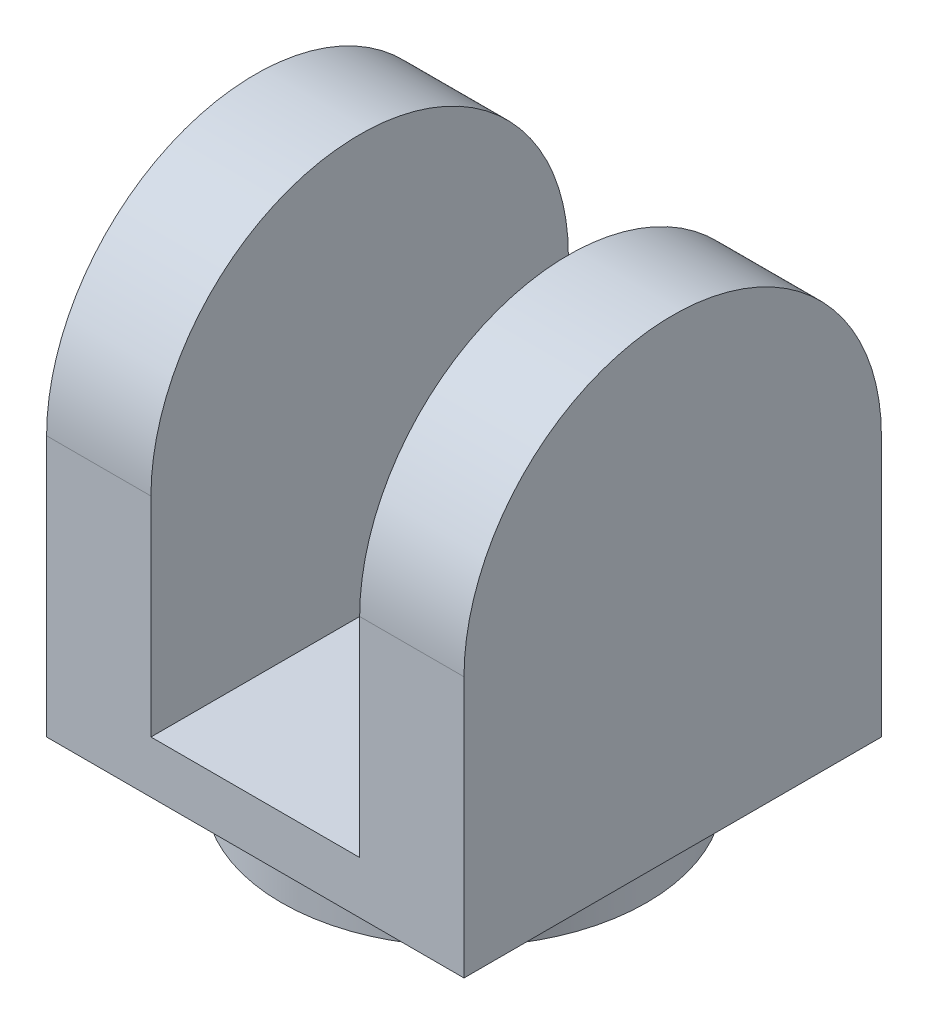
ISO-10303-21;
HEADER;
FILE_DESCRIPTION(('STEP AP214'),'2;1');
FILE_NAME('part.step','',(''),(''),'','','');
FILE_SCHEMA(('AUTOMOTIVE_DESIGN { 1 0 10303 214 1 1 1 1 }'));
ENDSEC;
DATA;
#1=APPLICATION_CONTEXT('core data for automotive mechanical design processes');
#2=APPLICATION_PROTOCOL_DEFINITION('international standard','automotive_design',2000,#1);
#3=PRODUCT_CONTEXT('',#1,'mechanical');
#4=PRODUCT('Part','Part','',(#3));
#5=PRODUCT_RELATED_PRODUCT_CATEGORY('part','',(#4));
#6=PRODUCT_DEFINITION_FORMATION('','',#4);
#7=PRODUCT_DEFINITION_CONTEXT('part definition',#1,'design');
#8=PRODUCT_DEFINITION('design','',#6,#7);
#9=PRODUCT_DEFINITION_SHAPE('','',#8);
#10=(LENGTH_UNIT() NAMED_UNIT(*) SI_UNIT(.MILLI.,.METRE.));
#11=(NAMED_UNIT(*) PLANE_ANGLE_UNIT() SI_UNIT($,.RADIAN.));
#12=(NAMED_UNIT(*) SI_UNIT($,.STERADIAN.) SOLID_ANGLE_UNIT());
#13=UNCERTAINTY_MEASURE_WITH_UNIT(LENGTH_MEASURE(1.E-05),#10,'distance_accuracy_value','');
#14=(GEOMETRIC_REPRESENTATION_CONTEXT(3) GLOBAL_UNCERTAINTY_ASSIGNED_CONTEXT((#13)) GLOBAL_UNIT_ASSIGNED_CONTEXT((#10,
#11,#12)) REPRESENTATION_CONTEXT('',''));
#15=CARTESIAN_POINT('',(0.,0.,0.));
#16=DIRECTION('',(0.,0.,1.));
#17=DIRECTION('',(1.,0.,0.));
#18=AXIS2_PLACEMENT_3D('',#15,#16,#17);
#19=CARTESIAN_POINT('',(-8.,20.,-8.));
#20=DIRECTION('',(0.,0.,1.));
#21=DIRECTION('',(1.,0.,0.));
#22=AXIS2_PLACEMENT_3D('',#19,#20,#21);
#23=PLANE('',#22);
#24=DIRECTION('',(1.,0.,0.));
#25=VECTOR('',#24,1.);
#26=CARTESIAN_POINT('',(-8.,12.,-7.99999999999999));
#27=LINE('',#26,#25);
#28=CARTESIAN_POINT('',(4.,12.,-8.));
#29=VERTEX_POINT('',#28);
#30=CARTESIAN_POINT('',(8.,12.,-8.));
#31=VERTEX_POINT('',#30);
#32=EDGE_CURVE('E109',#29,#31,#27,.T.);
#33=ORIENTED_EDGE('',*,*,#32,.T.);
#34=DIRECTION('',(0.,-1.,0.));
#35=VECTOR('',#34,1.);
#36=CARTESIAN_POINT('',(8.,20.,-8.));
#37=LINE('',#36,#35);
#38=CARTESIAN_POINT('',(8.,2.,-8.));
#39=VERTEX_POINT('',#38);
#40=EDGE_CURVE('E120',#31,#39,#37,.T.);
#41=ORIENTED_EDGE('',*,*,#40,.T.);
#42=DIRECTION('',(-1.,0.,0.));
#43=VECTOR('',#42,1.);
#44=CARTESIAN_POINT('',(-8.,2.,-8.));
#45=LINE('',#44,#43);
#46=CARTESIAN_POINT('',(-8.,2.,-8.));
#47=VERTEX_POINT('',#46);
#48=EDGE_CURVE('E118',#39,#47,#45,.T.);
#49=ORIENTED_EDGE('',*,*,#48,.T.);
#50=DIRECTION('',(0.,-1.,0.));
#51=VECTOR('',#50,1.);
#52=CARTESIAN_POINT('',(-8.,20.,-8.));
#53=LINE('',#52,#51);
#54=CARTESIAN_POINT('',(-8.,12.,-7.99999999999999));
#55=VERTEX_POINT('',#54);
#56=EDGE_CURVE('E61',#55,#47,#53,.T.);
#57=ORIENTED_EDGE('',*,*,#56,.F.);
#58=CARTESIAN_POINT('',(-4.,12.,-8.));
#59=VERTEX_POINT('',#58);
#60=EDGE_CURVE('E103',#55,#59,#27,.T.);
#61=ORIENTED_EDGE('',*,*,#60,.T.);
#62=DIRECTION('',(0.,-1.,0.));
#63=VECTOR('',#62,1.);
#64=CARTESIAN_POINT('',(-4.,20.,-8.));
#65=LINE('',#64,#63);
#66=CARTESIAN_POINT('',(-4.,4.,-8.));
#67=VERTEX_POINT('',#66);
#68=EDGE_CURVE('E180',#59,#67,#65,.T.);
#69=ORIENTED_EDGE('',*,*,#68,.T.);
#70=DIRECTION('',(1.,0.,0.));
#71=VECTOR('',#70,1.);
#72=CARTESIAN_POINT('',(-4.,4.,-8.));
#73=LINE('',#72,#71);
#74=CARTESIAN_POINT('',(4.,4.,-8.));
#75=VERTEX_POINT('',#74);
#76=EDGE_CURVE('E182',#67,#75,#73,.T.);
#77=ORIENTED_EDGE('',*,*,#76,.T.);
#78=DIRECTION('',(0.,1.,0.));
#79=VECTOR('',#78,1.);
#80=CARTESIAN_POINT('',(4.,20.,-8.));
#81=LINE('',#80,#79);
#82=EDGE_CURVE('E186',#75,#29,#81,.T.);
#83=ORIENTED_EDGE('',*,*,#82,.T.);
#84=EDGE_LOOP('',(#33,#41,#49,#57,#61,#69,#77,#83));
#85=FACE_BOUND('',#84,.T.);
#86=ADVANCED_FACE('F38',(#85),#23,.F.);
#87=CARTESIAN_POINT('',(0.,2.,0.));
#88=DIRECTION('',(0.,-1.,0.));
#89=DIRECTION('',(0.,0.,-1.));
#90=AXIS2_PLACEMENT_3D('',#87,#88,#89);
#91=CYLINDRICAL_SURFACE('',#90,7.);
#92=CARTESIAN_POINT('',(0.,2.,0.));
#93=DIRECTION('',(0.,1.,0.));
#94=DIRECTION('',(0.,0.,1.));
#95=AXIS2_PLACEMENT_3D('',#92,#93,#94);
#96=CIRCLE('',#95,7.);
#97=CARTESIAN_POINT('',(0.,2.,7.));
#98=VERTEX_POINT('',#97);
#99=EDGE_CURVE('E46',#98,#98,#96,.T.);
#100=ORIENTED_EDGE('',*,*,#99,.F.);
#101=EDGE_LOOP('',(#100));
#102=FACE_BOUND('',#101,.T.);
#103=CARTESIAN_POINT('',(0.,0.,0.));
#104=DIRECTION('',(0.,1.,0.));
#105=DIRECTION('',(0.,0.,1.));
#106=AXIS2_PLACEMENT_3D('',#103,#104,#105);
#107=CIRCLE('',#106,7.);
#108=CARTESIAN_POINT('',(0.,0.,7.));
#109=VERTEX_POINT('',#108);
#110=EDGE_CURVE('E130',#109,#109,#107,.T.);
#111=ORIENTED_EDGE('',*,*,#110,.T.);
#112=EDGE_LOOP('',(#111));
#113=FACE_BOUND('',#112,.T.);
#114=ADVANCED_FACE('F40',(#102,#113),#91,.T.);
#115=CARTESIAN_POINT('',(0.,0.,0.));
#116=DIRECTION('',(0.,1.,0.));
#117=DIRECTION('',(0.,0.,1.));
#118=AXIS2_PLACEMENT_3D('',#115,#116,#117);
#119=PLANE('',#118);
#120=ORIENTED_EDGE('',*,*,#110,.F.);
#121=EDGE_LOOP('',(#120));
#122=FACE_BOUND('',#121,.T.);
#123=ADVANCED_FACE('F136',(#122),#119,.F.);
#124=CARTESIAN_POINT('',(-8.,20.,-8.));
#125=DIRECTION('',(1.,0.,0.));
#126=DIRECTION('',(0.,0.,-1.));
#127=AXIS2_PLACEMENT_3D('',#124,#125,#126);
#128=PLANE('',#127);
#129=DIRECTION('',(0.,-1.,0.));
#130=VECTOR('',#129,1.);
#131=CARTESIAN_POINT('',(-7.99999999999999,20.,8.));
#132=LINE('',#131,#130);
#133=CARTESIAN_POINT('',(-7.99999999999999,12.,8.00000000000001));
#134=VERTEX_POINT('',#133);
#135=CARTESIAN_POINT('',(-7.99999999999999,2.,8.));
#136=VERTEX_POINT('',#135);
#137=EDGE_CURVE('E113',#134,#136,#132,.T.);
#138=ORIENTED_EDGE('',*,*,#137,.F.);
#139=CARTESIAN_POINT('',(-8.,12.,0.));
#140=DIRECTION('',(-1.,0.,0.));
#141=DIRECTION('',(0.,0.,-1.));
#142=AXIS2_PLACEMENT_3D('',#139,#140,#141);
#143=CIRCLE('',#142,8.);
#144=EDGE_CURVE('E105',#134,#55,#143,.T.);
#145=ORIENTED_EDGE('',*,*,#144,.T.);
#146=ORIENTED_EDGE('',*,*,#56,.T.);
#147=DIRECTION('',(0.,0.,1.));
#148=VECTOR('',#147,1.);
#149=CARTESIAN_POINT('',(-8.,2.,-8.));
#150=LINE('',#149,#148);
#151=EDGE_CURVE('E197',#47,#136,#150,.T.);
#152=ORIENTED_EDGE('',*,*,#151,.T.);
#153=EDGE_LOOP('',(#138,#145,#146,#152));
#154=FACE_BOUND('',#153,.T.);
#155=ADVANCED_FACE('F112',(#154),#128,.F.);
#156=CARTESIAN_POINT('',(-7.99999999999999,20.,8.));
#157=DIRECTION('',(0.,0.,-1.));
#158=DIRECTION('',(-1.,0.,0.));
#159=AXIS2_PLACEMENT_3D('',#156,#157,#158);
#160=PLANE('',#159);
#161=DIRECTION('',(0.,-1.,0.));
#162=VECTOR('',#161,1.);
#163=CARTESIAN_POINT('',(8.00000000000001,20.,8.));
#164=LINE('',#163,#162);
#165=CARTESIAN_POINT('',(8.00000000000001,12.,8.));
#166=VERTEX_POINT('',#165);
#167=CARTESIAN_POINT('',(8.00000000000001,2.,8.));
#168=VERTEX_POINT('',#167);
#169=EDGE_CURVE('E122',#166,#168,#164,.T.);
#170=ORIENTED_EDGE('',*,*,#169,.F.);
#171=DIRECTION('',(1.,0.,0.));
#172=VECTOR('',#171,1.);
#173=CARTESIAN_POINT('',(-7.99999999999999,12.,8.00000000000001));
#174=LINE('',#173,#172);
#175=CARTESIAN_POINT('',(4.,12.,8.));
#176=VERTEX_POINT('',#175);
#177=EDGE_CURVE('E108',#176,#166,#174,.T.);
#178=ORIENTED_EDGE('',*,*,#177,.F.);
#179=DIRECTION('',(0.,1.,0.));
#180=VECTOR('',#179,1.);
#181=CARTESIAN_POINT('',(4.,20.,8.));
#182=LINE('',#181,#180);
#183=CARTESIAN_POINT('',(4.,4.,8.));
#184=VERTEX_POINT('',#183);
#185=EDGE_CURVE('E183',#184,#176,#182,.T.);
#186=ORIENTED_EDGE('',*,*,#185,.F.);
#187=DIRECTION('',(1.,0.,0.));
#188=VECTOR('',#187,1.);
#189=CARTESIAN_POINT('',(-4.,4.,8.));
#190=LINE('',#189,#188);
#191=CARTESIAN_POINT('',(-4.,4.,8.));
#192=VERTEX_POINT('',#191);
#193=EDGE_CURVE('E191',#192,#184,#190,.T.);
#194=ORIENTED_EDGE('',*,*,#193,.F.);
#195=DIRECTION('',(0.,-1.,0.));
#196=VECTOR('',#195,1.);
#197=CARTESIAN_POINT('',(-4.,20.,8.));
#198=LINE('',#197,#196);
#199=CARTESIAN_POINT('',(-4.,12.,8.));
#200=VERTEX_POINT('',#199);
#201=EDGE_CURVE('E179',#200,#192,#198,.T.);
#202=ORIENTED_EDGE('',*,*,#201,.F.);
#203=EDGE_CURVE('E176',#134,#200,#174,.T.);
#204=ORIENTED_EDGE('',*,*,#203,.F.);
#205=ORIENTED_EDGE('',*,*,#137,.T.);
#206=DIRECTION('',(1.,0.,0.));
#207=VECTOR('',#206,1.);
#208=CARTESIAN_POINT('',(-7.99999999999999,2.,8.));
#209=LINE('',#208,#207);
#210=EDGE_CURVE('E167',#136,#168,#209,.T.);
#211=ORIENTED_EDGE('',*,*,#210,.T.);
#212=EDGE_LOOP('',(#170,#178,#186,#194,#202,#204,#205,#211));
#213=FACE_BOUND('',#212,.T.);
#214=ADVANCED_FACE('F142',(#213),#160,.F.);
#215=CARTESIAN_POINT('',(8.,20.,-8.));
#216=DIRECTION('',(-1.,0.,0.));
#217=DIRECTION('',(0.,0.,1.));
#218=AXIS2_PLACEMENT_3D('',#215,#216,#217);
#219=PLANE('',#218);
#220=ORIENTED_EDGE('',*,*,#40,.F.);
#221=CARTESIAN_POINT('',(8.,12.,0.));
#222=DIRECTION('',(-1.,0.,0.));
#223=DIRECTION('',(0.,0.,-1.));
#224=AXIS2_PLACEMENT_3D('',#221,#222,#223);
#225=CIRCLE('',#224,8.);
#226=EDGE_CURVE('E114',#166,#31,#225,.T.);
#227=ORIENTED_EDGE('',*,*,#226,.F.);
#228=ORIENTED_EDGE('',*,*,#169,.T.);
#229=DIRECTION('',(0.,0.,-1.));
#230=VECTOR('',#229,1.);
#231=CARTESIAN_POINT('',(8.,2.,-8.));
#232=LINE('',#231,#230);
#233=EDGE_CURVE('E124',#168,#39,#232,.T.);
#234=ORIENTED_EDGE('',*,*,#233,.T.);
#235=EDGE_LOOP('',(#220,#227,#228,#234));
#236=FACE_BOUND('',#235,.T.);
#237=ADVANCED_FACE('F153',(#236),#219,.F.);
#238=CARTESIAN_POINT('',(0.,2.,0.));
#239=DIRECTION('',(0.,1.,0.));
#240=DIRECTION('',(0.,0.,1.));
#241=AXIS2_PLACEMENT_3D('',#238,#239,#240);
#242=PLANE('',#241);
#243=ORIENTED_EDGE('',*,*,#99,.T.);
#244=EDGE_LOOP('',(#243));
#245=FACE_BOUND('',#244,.T.);
#246=ORIENTED_EDGE('',*,*,#151,.F.);
#247=ORIENTED_EDGE('',*,*,#48,.F.);
#248=ORIENTED_EDGE('',*,*,#233,.F.);
#249=ORIENTED_EDGE('',*,*,#210,.F.);
#250=EDGE_LOOP('',(#246,#247,#248,#249));
#251=FACE_BOUND('',#250,.T.);
#252=ADVANCED_FACE('F151',(#245,#251),#242,.F.);
#253=CARTESIAN_POINT('',(-4.,20.,-8.));
#254=DIRECTION('',(-1.,0.,0.));
#255=DIRECTION('',(0.,-1.,0.));
#256=AXIS2_PLACEMENT_3D('',#253,#254,#255);
#257=PLANE('',#256);
#258=ORIENTED_EDGE('',*,*,#68,.F.);
#259=CARTESIAN_POINT('',(-4.,12.,0.));
#260=DIRECTION('',(-1.,0.,0.));
#261=DIRECTION('',(0.,-1.,0.));
#262=AXIS2_PLACEMENT_3D('',#259,#260,#261);
#263=CIRCLE('',#262,8.);
#264=EDGE_CURVE('E53',#59,#200,#263,.F.);
#265=ORIENTED_EDGE('',*,*,#264,.T.);
#266=ORIENTED_EDGE('',*,*,#201,.T.);
#267=DIRECTION('',(0.,0.,1.));
#268=VECTOR('',#267,1.);
#269=CARTESIAN_POINT('',(-4.,4.,-8.));
#270=LINE('',#269,#268);
#271=EDGE_CURVE('E189',#67,#192,#270,.T.);
#272=ORIENTED_EDGE('',*,*,#271,.F.);
#273=EDGE_LOOP('',(#258,#265,#266,#272));
#274=FACE_BOUND('',#273,.T.);
#275=ADVANCED_FACE('F203',(#274),#257,.F.);
#276=CARTESIAN_POINT('',(4.,20.,-8.));
#277=DIRECTION('',(1.,0.,0.));
#278=DIRECTION('',(0.,1.,0.));
#279=AXIS2_PLACEMENT_3D('',#276,#277,#278);
#280=PLANE('',#279);
#281=CARTESIAN_POINT('',(4.,12.,0.));
#282=DIRECTION('',(1.,0.,0.));
#283=DIRECTION('',(0.,1.,0.));
#284=AXIS2_PLACEMENT_3D('',#281,#282,#283);
#285=CIRCLE('',#284,8.);
#286=EDGE_CURVE('E11',#176,#29,#285,.F.);
#287=ORIENTED_EDGE('',*,*,#286,.T.);
#288=ORIENTED_EDGE('',*,*,#82,.F.);
#289=DIRECTION('',(0.,0.,1.));
#290=VECTOR('',#289,1.);
#291=CARTESIAN_POINT('',(4.,4.,-8.));
#292=LINE('',#291,#290);
#293=EDGE_CURVE('E195',#75,#184,#292,.T.);
#294=ORIENTED_EDGE('',*,*,#293,.T.);
#295=ORIENTED_EDGE('',*,*,#185,.T.);
#296=EDGE_LOOP('',(#287,#288,#294,#295));
#297=FACE_BOUND('',#296,.T.);
#298=ADVANCED_FACE('F208',(#297),#280,.F.);
#299=CARTESIAN_POINT('',(-4.,4.,-8.));
#300=DIRECTION('',(0.,-1.,0.));
#301=DIRECTION('',(0.,0.,-1.));
#302=AXIS2_PLACEMENT_3D('',#299,#300,#301);
#303=PLANE('',#302);
#304=ORIENTED_EDGE('',*,*,#193,.T.);
#305=ORIENTED_EDGE('',*,*,#293,.F.);
#306=ORIENTED_EDGE('',*,*,#76,.F.);
#307=ORIENTED_EDGE('',*,*,#271,.T.);
#308=EDGE_LOOP('',(#304,#305,#306,#307));
#309=FACE_BOUND('',#308,.T.);
#310=ADVANCED_FACE('F213',(#309),#303,.F.);
#311=CARTESIAN_POINT('',(-8.,12.,0.));
#312=DIRECTION('',(1.,0.,0.));
#313=DIRECTION('',(0.,0.,-1.));
#314=AXIS2_PLACEMENT_3D('',#311,#312,#313);
#315=CYLINDRICAL_SURFACE('',#314,8.);
#316=ORIENTED_EDGE('',*,*,#226,.T.);
#317=ORIENTED_EDGE('',*,*,#32,.F.);
#318=ORIENTED_EDGE('',*,*,#286,.F.);
#319=ORIENTED_EDGE('',*,*,#177,.T.);
#320=EDGE_LOOP('',(#316,#317,#318,#319));
#321=FACE_BOUND('',#320,.T.);
#322=ADVANCED_FACE('F218',(#321),#315,.T.);
#323=ORIENTED_EDGE('',*,*,#264,.F.);
#324=ORIENTED_EDGE('',*,*,#60,.F.);
#325=ORIENTED_EDGE('',*,*,#144,.F.);
#326=ORIENTED_EDGE('',*,*,#203,.T.);
#327=EDGE_LOOP('',(#323,#324,#325,#326));
#328=FACE_BOUND('',#327,.T.);
#329=ADVANCED_FACE('F104',(#328),#315,.T.);
#330=CLOSED_SHELL('',(#86,#114,#123,#155,#214,#237,#252,#275,#298,#310,#322,#329));
#331=MANIFOLD_SOLID_BREP('B2',#330);
#332=ADVANCED_BREP_SHAPE_REPRESENTATION('',(#18,#331),#14);
#333=SHAPE_DEFINITION_REPRESENTATION(#9,#332);
ENDSEC;
END-ISO-10303-21;
